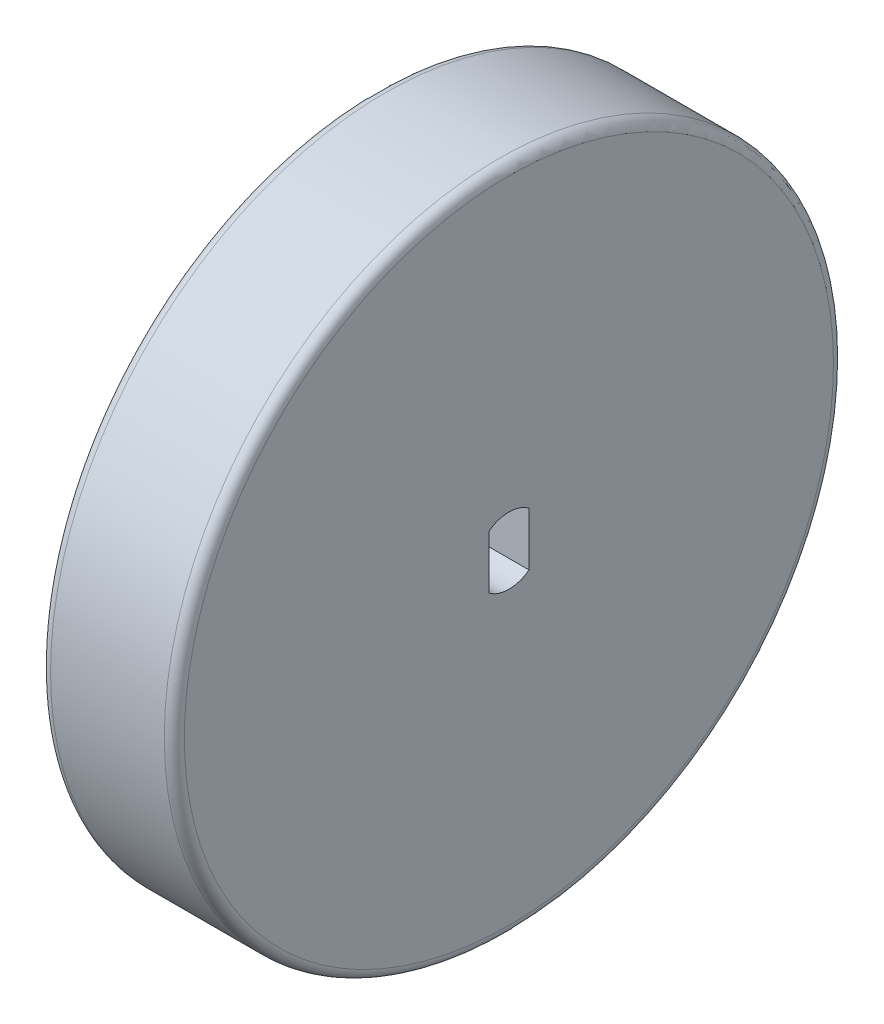
ISO-10303-21;
HEADER;
FILE_DESCRIPTION(('STEP AP214'),'2;1');
FILE_NAME('part.step','',(''),(''),'','','');
FILE_SCHEMA(('AUTOMOTIVE_DESIGN { 1 0 10303 214 1 1 1 1 }'));
ENDSEC;
DATA;
#1=APPLICATION_CONTEXT('core data for automotive mechanical design processes');
#2=APPLICATION_PROTOCOL_DEFINITION('international standard','automotive_design',2000,#1);
#3=PRODUCT_CONTEXT('',#1,'mechanical');
#4=PRODUCT('Part','Part','',(#3));
#5=PRODUCT_RELATED_PRODUCT_CATEGORY('part','',(#4));
#6=PRODUCT_DEFINITION_FORMATION('','',#4);
#7=PRODUCT_DEFINITION_CONTEXT('part definition',#1,'design');
#8=PRODUCT_DEFINITION('design','',#6,#7);
#9=PRODUCT_DEFINITION_SHAPE('','',#8);
#10=(LENGTH_UNIT() NAMED_UNIT(*) SI_UNIT(.MILLI.,.METRE.));
#11=(NAMED_UNIT(*) PLANE_ANGLE_UNIT() SI_UNIT($,.RADIAN.));
#12=(NAMED_UNIT(*) SI_UNIT($,.STERADIAN.) SOLID_ANGLE_UNIT());
#13=UNCERTAINTY_MEASURE_WITH_UNIT(LENGTH_MEASURE(1.E-05),#10,'distance_accuracy_value','');
#14=(GEOMETRIC_REPRESENTATION_CONTEXT(3) GLOBAL_UNCERTAINTY_ASSIGNED_CONTEXT((#13)) GLOBAL_UNIT_ASSIGNED_CONTEXT((#10,
#11,#12)) REPRESENTATION_CONTEXT('',''));
#15=CARTESIAN_POINT('',(0.,0.,0.));
#16=DIRECTION('',(0.,0.,1.));
#17=DIRECTION('',(1.,0.,0.));
#18=AXIS2_PLACEMENT_3D('',#15,#16,#17);
#19=CARTESIAN_POINT('',(10.16,0.,0.));
#20=DIRECTION('',(-1.,0.,0.));
#21=DIRECTION('',(0.,0.,1.));
#22=AXIS2_PLACEMENT_3D('',#19,#20,#21);
#23=CYLINDRICAL_SURFACE('',#22,25.4);
#24=CARTESIAN_POINT('',(0.762000000000001,0.,0.));
#25=DIRECTION('',(1.,0.,0.));
#26=DIRECTION('',(0.,0.,-1.));
#27=AXIS2_PLACEMENT_3D('',#24,#25,#26);
#28=CIRCLE('',#27,25.4);
#29=CARTESIAN_POINT('',(0.762000000000001,0.,-25.4));
#30=VERTEX_POINT('',#29);
#31=EDGE_CURVE('E115',#30,#30,#28,.T.);
#32=ORIENTED_EDGE('',*,*,#31,.T.);
#33=EDGE_LOOP('',(#32));
#34=FACE_BOUND('',#33,.T.);
#35=CARTESIAN_POINT('',(9.398,0.,0.));
#36=DIRECTION('',(1.,0.,0.));
#37=DIRECTION('',(0.,0.,-1.));
#38=AXIS2_PLACEMENT_3D('',#35,#36,#37);
#39=CIRCLE('',#38,25.4);
#40=CARTESIAN_POINT('',(9.398,0.,-25.4));
#41=VERTEX_POINT('',#40);
#42=EDGE_CURVE('E109',#41,#41,#39,.F.);
#43=ORIENTED_EDGE('',*,*,#42,.T.);
#44=EDGE_LOOP('',(#43));
#45=FACE_BOUND('',#44,.T.);
#46=ADVANCED_FACE('F35',(#34,#45),#23,.T.);
#47=CARTESIAN_POINT('',(10.16,0.,0.));
#48=DIRECTION('',(1.,0.,0.));
#49=DIRECTION('',(0.,0.,-1.));
#50=AXIS2_PLACEMENT_3D('',#47,#48,#49);
#51=PLANE('',#50);
#52=CARTESIAN_POINT('',(10.16,0.,0.));
#53=DIRECTION('',(1.,0.,0.));
#54=DIRECTION('',(0.,0.,-1.));
#55=AXIS2_PLACEMENT_3D('',#52,#53,#54);
#56=CIRCLE('',#55,2.54);
#57=CARTESIAN_POINT('',(10.16,-2.032,1.524));
#58=VERTEX_POINT('',#57);
#59=CARTESIAN_POINT('',(10.16,-2.032,-1.524));
#60=VERTEX_POINT('',#59);
#61=EDGE_CURVE('E50',#58,#60,#56,.T.);
#62=ORIENTED_EDGE('',*,*,#61,.F.);
#63=DIRECTION('',(0.,-1.,0.));
#64=VECTOR('',#63,1.);
#65=CARTESIAN_POINT('',(10.16,-2.032,1.524));
#66=LINE('',#65,#64);
#67=CARTESIAN_POINT('',(10.16,2.032,1.524));
#68=VERTEX_POINT('',#67);
#69=EDGE_CURVE('E94',#68,#58,#66,.T.);
#70=ORIENTED_EDGE('',*,*,#69,.F.);
#71=CARTESIAN_POINT('',(10.16,0.,0.));
#72=DIRECTION('',(1.,0.,0.));
#73=DIRECTION('',(0.,0.,-1.));
#74=AXIS2_PLACEMENT_3D('',#71,#72,#73);
#75=CIRCLE('',#74,2.54);
#76=CARTESIAN_POINT('',(10.16,2.032,-1.524));
#77=VERTEX_POINT('',#76);
#78=EDGE_CURVE('E97',#77,#68,#75,.T.);
#79=ORIENTED_EDGE('',*,*,#78,.F.);
#80=DIRECTION('',(0.,1.,0.));
#81=VECTOR('',#80,1.);
#82=CARTESIAN_POINT('',(10.16,2.032,-1.524));
#83=LINE('',#82,#81);
#84=EDGE_CURVE('E103',#60,#77,#83,.T.);
#85=ORIENTED_EDGE('',*,*,#84,.F.);
#86=EDGE_LOOP('',(#62,#70,#79,#85));
#87=FACE_BOUND('',#86,.T.);
#88=CARTESIAN_POINT('',(10.16,0.,0.));
#89=DIRECTION('',(1.,0.,0.));
#90=DIRECTION('',(0.,0.,-1.));
#91=AXIS2_PLACEMENT_3D('',#88,#89,#90);
#92=CIRCLE('',#91,24.638);
#93=CARTESIAN_POINT('',(10.16,0.,-24.638));
#94=VERTEX_POINT('',#93);
#95=EDGE_CURVE('E11',#94,#94,#92,.T.);
#96=ORIENTED_EDGE('',*,*,#95,.T.);
#97=EDGE_LOOP('',(#96));
#98=FACE_BOUND('',#97,.T.);
#99=ADVANCED_FACE('F127',(#87,#98),#51,.T.);
#100=CARTESIAN_POINT('',(0.,0.,0.));
#101=DIRECTION('',(1.,0.,0.));
#102=DIRECTION('',(0.,0.,-1.));
#103=AXIS2_PLACEMENT_3D('',#100,#101,#102);
#104=PLANE('',#103);
#105=DIRECTION('',(0.,-1.,0.));
#106=VECTOR('',#105,1.);
#107=CARTESIAN_POINT('',(0.,-2.032,1.524));
#108=LINE('',#107,#106);
#109=CARTESIAN_POINT('',(0.,2.032,1.524));
#110=VERTEX_POINT('',#109);
#111=CARTESIAN_POINT('',(0.,-2.032,1.524));
#112=VERTEX_POINT('',#111);
#113=EDGE_CURVE('E84',#110,#112,#108,.T.);
#114=ORIENTED_EDGE('',*,*,#113,.T.);
#115=CARTESIAN_POINT('',(0.,0.,0.));
#116=DIRECTION('',(1.,0.,0.));
#117=DIRECTION('',(0.,0.,-1.));
#118=AXIS2_PLACEMENT_3D('',#115,#116,#117);
#119=CIRCLE('',#118,2.54);
#120=CARTESIAN_POINT('',(0.,-2.032,-1.524));
#121=VERTEX_POINT('',#120);
#122=EDGE_CURVE('E78',#112,#121,#119,.T.);
#123=ORIENTED_EDGE('',*,*,#122,.T.);
#124=DIRECTION('',(0.,1.,0.));
#125=VECTOR('',#124,1.);
#126=CARTESIAN_POINT('',(0.,2.032,-1.524));
#127=LINE('',#126,#125);
#128=CARTESIAN_POINT('',(0.,2.032,-1.524));
#129=VERTEX_POINT('',#128);
#130=EDGE_CURVE('E87',#121,#129,#127,.T.);
#131=ORIENTED_EDGE('',*,*,#130,.T.);
#132=CARTESIAN_POINT('',(0.,0.,0.));
#133=DIRECTION('',(1.,0.,0.));
#134=DIRECTION('',(0.,0.,-1.));
#135=AXIS2_PLACEMENT_3D('',#132,#133,#134);
#136=CIRCLE('',#135,2.54);
#137=EDGE_CURVE('E58',#129,#110,#136,.T.);
#138=ORIENTED_EDGE('',*,*,#137,.T.);
#139=EDGE_LOOP('',(#114,#123,#131,#138));
#140=FACE_BOUND('',#139,.T.);
#141=CARTESIAN_POINT('',(0.,0.,0.));
#142=DIRECTION('',(1.,0.,0.));
#143=DIRECTION('',(0.,0.,-1.));
#144=AXIS2_PLACEMENT_3D('',#141,#142,#143);
#145=CIRCLE('',#144,24.638);
#146=CARTESIAN_POINT('',(0.,0.,-24.638));
#147=VERTEX_POINT('',#146);
#148=EDGE_CURVE('E43',#147,#147,#145,.F.);
#149=ORIENTED_EDGE('',*,*,#148,.T.);
#150=EDGE_LOOP('',(#149));
#151=FACE_BOUND('',#150,.T.);
#152=ADVANCED_FACE('F91',(#140,#151),#104,.F.);
#153=CARTESIAN_POINT('',(0.762000000000001,0.,0.));
#154=DIRECTION('',(1.,0.,0.));
#155=DIRECTION('',(0.,0.,-1.));
#156=AXIS2_PLACEMENT_3D('',#153,#154,#155);
#157=TOROIDAL_SURFACE('',#156,24.638,0.762);
#158=ORIENTED_EDGE('',*,*,#148,.F.);
#159=EDGE_LOOP('',(#158));
#160=FACE_BOUND('',#159,.T.);
#161=ORIENTED_EDGE('',*,*,#31,.F.);
#162=EDGE_LOOP('',(#161));
#163=FACE_BOUND('',#162,.T.);
#164=ADVANCED_FACE('F120',(#160,#163),#157,.T.);
#165=CARTESIAN_POINT('',(9.398,0.,0.));
#166=DIRECTION('',(1.,0.,0.));
#167=DIRECTION('',(0.,0.,-1.));
#168=AXIS2_PLACEMENT_3D('',#165,#166,#167);
#169=TOROIDAL_SURFACE('',#168,24.638,0.762);
#170=ORIENTED_EDGE('',*,*,#42,.F.);
#171=EDGE_LOOP('',(#170));
#172=FACE_BOUND('',#171,.T.);
#173=ORIENTED_EDGE('',*,*,#95,.F.);
#174=EDGE_LOOP('',(#173));
#175=FACE_BOUND('',#174,.T.);
#176=ADVANCED_FACE('F37',(#172,#175),#169,.T.);
#177=CARTESIAN_POINT('',(0.,0.,0.));
#178=DIRECTION('',(1.,0.,0.));
#179=DIRECTION('',(0.,0.,-1.));
#180=AXIS2_PLACEMENT_3D('',#177,#178,#179);
#181=CYLINDRICAL_SURFACE('',#180,2.54);
#182=ORIENTED_EDGE('',*,*,#61,.T.);
#183=DIRECTION('',(1.,0.,0.));
#184=VECTOR('',#183,1.);
#185=CARTESIAN_POINT('',(0.,-2.032,-1.524));
#186=LINE('',#185,#184);
#187=EDGE_CURVE('E74',#121,#60,#186,.T.);
#188=ORIENTED_EDGE('',*,*,#187,.F.);
#189=ORIENTED_EDGE('',*,*,#122,.F.);
#190=DIRECTION('',(1.,0.,0.));
#191=VECTOR('',#190,1.);
#192=CARTESIAN_POINT('',(0.,-2.032,1.524));
#193=LINE('',#192,#191);
#194=EDGE_CURVE('E107',#112,#58,#193,.T.);
#195=ORIENTED_EDGE('',*,*,#194,.T.);
#196=EDGE_LOOP('',(#182,#188,#189,#195));
#197=FACE_BOUND('',#196,.T.);
#198=ADVANCED_FACE('F76',(#197),#181,.F.);
#199=CARTESIAN_POINT('',(0.,-2.032,1.524));
#200=DIRECTION('',(0.,0.,1.));
#201=DIRECTION('',(1.,0.,0.));
#202=AXIS2_PLACEMENT_3D('',#199,#200,#201);
#203=PLANE('',#202);
#204=ORIENTED_EDGE('',*,*,#69,.T.);
#205=ORIENTED_EDGE('',*,*,#194,.F.);
#206=ORIENTED_EDGE('',*,*,#113,.F.);
#207=DIRECTION('',(1.,0.,0.));
#208=VECTOR('',#207,1.);
#209=CARTESIAN_POINT('',(0.,2.032,1.524));
#210=LINE('',#209,#208);
#211=EDGE_CURVE('E110',#110,#68,#210,.T.);
#212=ORIENTED_EDGE('',*,*,#211,.T.);
#213=EDGE_LOOP('',(#204,#205,#206,#212));
#214=FACE_BOUND('',#213,.T.);
#215=ADVANCED_FACE('F145',(#214),#203,.F.);
#216=CARTESIAN_POINT('',(0.,0.,0.));
#217=DIRECTION('',(1.,0.,0.));
#218=DIRECTION('',(0.,0.,-1.));
#219=AXIS2_PLACEMENT_3D('',#216,#217,#218);
#220=CYLINDRICAL_SURFACE('',#219,2.54);
#221=ORIENTED_EDGE('',*,*,#78,.T.);
#222=ORIENTED_EDGE('',*,*,#211,.F.);
#223=ORIENTED_EDGE('',*,*,#137,.F.);
#224=DIRECTION('',(1.,0.,0.));
#225=VECTOR('',#224,1.);
#226=CARTESIAN_POINT('',(0.,2.032,-1.524));
#227=LINE('',#226,#225);
#228=EDGE_CURVE('E83',#129,#77,#227,.T.);
#229=ORIENTED_EDGE('',*,*,#228,.T.);
#230=EDGE_LOOP('',(#221,#222,#223,#229));
#231=FACE_BOUND('',#230,.T.);
#232=ADVANCED_FACE('F148',(#231),#220,.F.);
#233=CARTESIAN_POINT('',(0.,2.032,-1.524));
#234=DIRECTION('',(0.,0.,-1.));
#235=DIRECTION('',(-1.,0.,0.));
#236=AXIS2_PLACEMENT_3D('',#233,#234,#235);
#237=PLANE('',#236);
#238=ORIENTED_EDGE('',*,*,#84,.T.);
#239=ORIENTED_EDGE('',*,*,#228,.F.);
#240=ORIENTED_EDGE('',*,*,#130,.F.);
#241=ORIENTED_EDGE('',*,*,#187,.T.);
#242=EDGE_LOOP('',(#238,#239,#240,#241));
#243=FACE_BOUND('',#242,.T.);
#244=ADVANCED_FACE('F88',(#243),#237,.F.);
#245=CLOSED_SHELL('',(#46,#99,#152,#164,#176,#198,#215,#232,#244));
#246=MANIFOLD_SOLID_BREP('B2',#245);
#247=ADVANCED_BREP_SHAPE_REPRESENTATION('',(#18,#246),#14);
#248=SHAPE_DEFINITION_REPRESENTATION(#9,#247);
ENDSEC;
END-ISO-10303-21;
